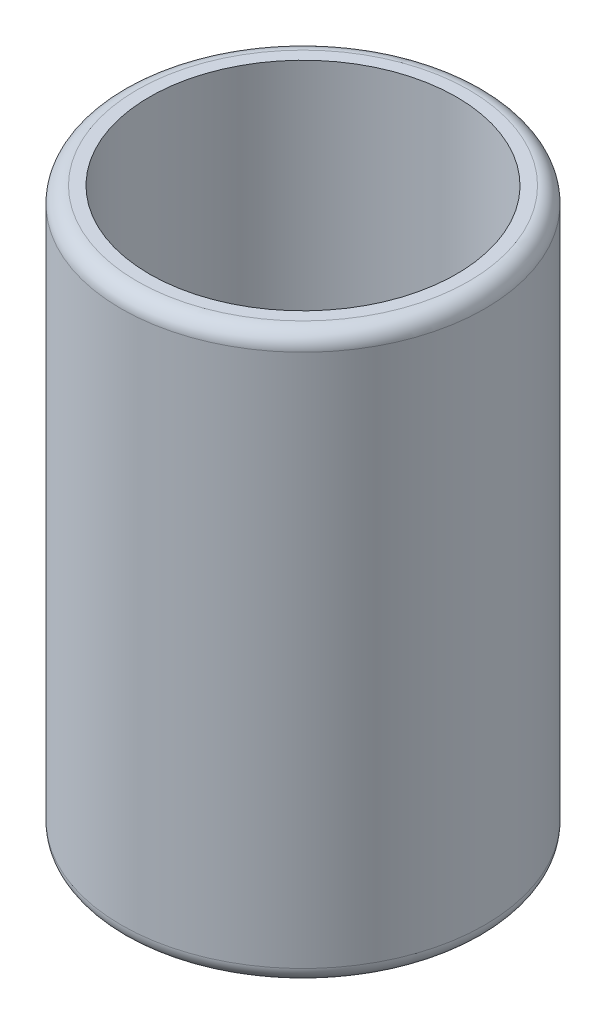
ISO-10303-21;
HEADER;
FILE_DESCRIPTION(('STEP AP214'),'2;1');
FILE_NAME('part.step','',(''),(''),'','','');
FILE_SCHEMA(('AUTOMOTIVE_DESIGN { 1 0 10303 214 1 1 1 1 }'));
ENDSEC;
DATA;
#1=APPLICATION_CONTEXT('core data for automotive mechanical design processes');
#2=APPLICATION_PROTOCOL_DEFINITION('international standard','automotive_design',2000,#1);
#3=PRODUCT_CONTEXT('',#1,'mechanical');
#4=PRODUCT('Part','Part','',(#3));
#5=PRODUCT_RELATED_PRODUCT_CATEGORY('part','',(#4));
#6=PRODUCT_DEFINITION_FORMATION('','',#4);
#7=PRODUCT_DEFINITION_CONTEXT('part definition',#1,'design');
#8=PRODUCT_DEFINITION('design','',#6,#7);
#9=PRODUCT_DEFINITION_SHAPE('','',#8);
#10=(LENGTH_UNIT() NAMED_UNIT(*) SI_UNIT(.MILLI.,.METRE.));
#11=(NAMED_UNIT(*) PLANE_ANGLE_UNIT() SI_UNIT($,.RADIAN.));
#12=(NAMED_UNIT(*) SI_UNIT($,.STERADIAN.) SOLID_ANGLE_UNIT());
#13=UNCERTAINTY_MEASURE_WITH_UNIT(LENGTH_MEASURE(1.E-05),#10,'distance_accuracy_value','');
#14=(GEOMETRIC_REPRESENTATION_CONTEXT(3) GLOBAL_UNCERTAINTY_ASSIGNED_CONTEXT((#13)) GLOBAL_UNIT_ASSIGNED_CONTEXT((#10,
#11,#12)) REPRESENTATION_CONTEXT('',''));
#15=CARTESIAN_POINT('',(0.,0.,0.));
#16=DIRECTION('',(0.,0.,1.));
#17=DIRECTION('',(1.,0.,0.));
#18=AXIS2_PLACEMENT_3D('',#15,#16,#17);
#19=CARTESIAN_POINT('',(0.,8.89,0.));
#20=DIRECTION('',(0.,-1.,0.));
#21=DIRECTION('',(0.,0.,-1.));
#22=AXIS2_PLACEMENT_3D('',#19,#20,#21);
#23=CYLINDRICAL_SURFACE('',#22,57.15);
#24=CARTESIAN_POINT('',(0.,5.,0.));
#25=DIRECTION('',(0.,1.,0.));
#26=DIRECTION('',(0.,0.,1.));
#27=AXIS2_PLACEMENT_3D('',#24,#25,#26);
#28=CIRCLE('',#27,57.15);
#29=CARTESIAN_POINT('',(0.,5.,-57.15));
#30=VERTEX_POINT('',#29);
#31=EDGE_CURVE('E56',#30,#30,#28,.T.);
#32=CARTESIAN_POINT('',(0.,172.8,0.));
#33=DIRECTION('',(0.,1.,0.));
#34=DIRECTION('',(0.,0.,1.));
#35=AXIS2_PLACEMENT_3D('',#32,#33,#34);
#36=CIRCLE('',#35,57.15);
#37=CARTESIAN_POINT('',(0.,172.8,-57.15));
#38=VERTEX_POINT('',#37);
#39=EDGE_CURVE('E61',#38,#38,#36,.F.);
#40=CARTESIAN_POINT('',(0.,5.,-57.15));
#41=CARTESIAN_POINT('',(0.,6.74791666666666,-57.15));
#42=CARTESIAN_POINT('',(0.,8.49583333333333,-57.15));
#43=CARTESIAN_POINT('',(0.,11.9916666666667,-57.15));
#44=CARTESIAN_POINT('',(0.,13.7395833333333,-57.15));
#45=CARTESIAN_POINT('',(0.,17.2354166666667,-57.15));
#46=CARTESIAN_POINT('',(0.,18.9833333333333,-57.15));
#47=CARTESIAN_POINT('',(0.,22.4791666666667,-57.15));
#48=CARTESIAN_POINT('',(0.,24.2270833333333,-57.15));
#49=CARTESIAN_POINT('',(0.,27.7229166666667,-57.15));
#50=CARTESIAN_POINT('',(0.,29.4708333333333,-57.15));
#51=CARTESIAN_POINT('',(0.,32.9666666666667,-57.15));
#52=CARTESIAN_POINT('',(0.,34.7145833333333,-57.15));
#53=CARTESIAN_POINT('',(0.,38.2104166666667,-57.15));
#54=CARTESIAN_POINT('',(0.,39.9583333333333,-57.15));
#55=CARTESIAN_POINT('',(0.,43.4541666666667,-57.15));
#56=CARTESIAN_POINT('',(0.,45.2020833333333,-57.15));
#57=CARTESIAN_POINT('',(0.,48.6979166666667,-57.15));
#58=CARTESIAN_POINT('',(0.,50.4458333333333,-57.15));
#59=CARTESIAN_POINT('',(0.,53.9416666666667,-57.15));
#60=CARTESIAN_POINT('',(0.,55.6895833333333,-57.15));
#61=CARTESIAN_POINT('',(0.,59.1854166666667,-57.15));
#62=CARTESIAN_POINT('',(0.,60.9333333333333,-57.15));
#63=CARTESIAN_POINT('',(0.,64.4291666666667,-57.15));
#64=CARTESIAN_POINT('',(0.,66.1770833333333,-57.15));
#65=CARTESIAN_POINT('',(0.,69.6729166666667,-57.15));
#66=CARTESIAN_POINT('',(0.,71.4208333333333,-57.15));
#67=CARTESIAN_POINT('',(0.,74.9166666666666,-57.15));
#68=CARTESIAN_POINT('',(0.,76.6645833333333,-57.15));
#69=CARTESIAN_POINT('',(0.,80.1604166666666,-57.15));
#70=CARTESIAN_POINT('',(0.,81.9083333333333,-57.15));
#71=CARTESIAN_POINT('',(0.,85.4041666666666,-57.15));
#72=CARTESIAN_POINT('',(0.,87.1520833333333,-57.15));
#73=CARTESIAN_POINT('',(0.,90.6479166666666,-57.15));
#74=CARTESIAN_POINT('',(0.,92.3958333333333,-57.15));
#75=CARTESIAN_POINT('',(0.,95.8916666666667,-57.15));
#76=CARTESIAN_POINT('',(0.,97.6395833333333,-57.15));
#77=CARTESIAN_POINT('',(0.,101.135416666667,-57.15));
#78=CARTESIAN_POINT('',(0.,102.883333333333,-57.15));
#79=CARTESIAN_POINT('',(0.,106.379166666667,-57.15));
#80=CARTESIAN_POINT('',(0.,108.127083333333,-57.15));
#81=CARTESIAN_POINT('',(0.,111.622916666667,-57.15));
#82=CARTESIAN_POINT('',(0.,113.370833333333,-57.15));
#83=CARTESIAN_POINT('',(0.,116.866666666667,-57.15));
#84=CARTESIAN_POINT('',(0.,118.614583333333,-57.15));
#85=CARTESIAN_POINT('',(0.,122.110416666667,-57.15));
#86=CARTESIAN_POINT('',(0.,123.858333333333,-57.15));
#87=CARTESIAN_POINT('',(0.,127.354166666667,-57.15));
#88=CARTESIAN_POINT('',(0.,129.102083333333,-57.15));
#89=CARTESIAN_POINT('',(0.,132.597916666667,-57.15));
#90=CARTESIAN_POINT('',(0.,134.345833333333,-57.15));
#91=CARTESIAN_POINT('',(0.,137.841666666667,-57.15));
#92=CARTESIAN_POINT('',(0.,139.589583333333,-57.15));
#93=CARTESIAN_POINT('',(0.,143.085416666667,-57.15));
#94=CARTESIAN_POINT('',(0.,144.833333333333,-57.15));
#95=CARTESIAN_POINT('',(0.,148.329166666667,-57.15));
#96=CARTESIAN_POINT('',(0.,150.077083333333,-57.15));
#97=CARTESIAN_POINT('',(0.,153.572916666667,-57.15));
#98=CARTESIAN_POINT('',(0.,155.320833333333,-57.15));
#99=CARTESIAN_POINT('',(0.,158.816666666667,-57.15));
#100=CARTESIAN_POINT('',(0.,160.564583333333,-57.15));
#101=CARTESIAN_POINT('',(0.,164.060416666667,-57.15));
#102=CARTESIAN_POINT('',(0.,165.808333333333,-57.15));
#103=CARTESIAN_POINT('',(0.,169.304166666667,-57.15));
#104=CARTESIAN_POINT('',(0.,171.052083333333,-57.15));
#105=CARTESIAN_POINT('',(0.,172.8,-57.15));
#106=B_SPLINE_CURVE_WITH_KNOTS('',3,(#40,#41,#42,#43,#44,#45,#46,#47,#48,#49,#50,#51,#52,#53,
#54,#55,#56,#57,#58,#59,#60,#61,#62,#63,#64,#65,#66,#67,#68,#69,#70,#71,#72,#73,#74,#75,#76,#77,
#78,#79,#80,#81,#82,#83,#84,#85,#86,#87,#88,#89,#90,#91,#92,#93,#94,#95,#96,#97,#98,#99,#100,
#101,#102,#103,#104,#105),.UNSPECIFIED.,.F.,.F.,(4,2,2,2,2,2,2,2,2,2,2,2,2,2,2,2,2,2,2,2,2,2,2,
2,2,2,2,2,2,2,2,2,4),(0.,5.24375,10.4875,15.73125,20.975,26.21875,31.4625,36.70625,41.95,
47.19375,52.4375,57.68125,62.925,68.16875,73.4125,78.65625,83.9,89.14375,94.3875,99.63125,
104.875,110.11875,115.3625,120.60625,125.85,131.09375,136.3375,141.58125,146.825,152.06875,
157.3125,162.55625,167.8),.UNSPECIFIED.);
#107=EDGE_CURVE('BSEAM43',#30,#38,#106,.T.);
#108=ORIENTED_EDGE('',*,*,#31,.T.);
#109=ORIENTED_EDGE('',*,*,#39,.T.);
#110=ORIENTED_EDGE('',*,*,#107,.T.);
#111=ORIENTED_EDGE('',*,*,#107,.F.);
#112=EDGE_LOOP('',(#108,#110,#109,#111));
#113=FACE_BOUND('',#112,.T.);
#114=ADVANCED_FACE('F43',(#113),#23,.T.);
#115=CARTESIAN_POINT('',(0.,0.,0.));
#116=DIRECTION('',(0.,1.,0.));
#117=DIRECTION('',(0.,0.,1.));
#118=AXIS2_PLACEMENT_3D('',#115,#116,#117);
#119=PLANE('',#118);
#120=CARTESIAN_POINT('',(0.,0.,0.));
#121=DIRECTION('',(0.,1.,0.));
#122=DIRECTION('',(0.,0.,1.));
#123=AXIS2_PLACEMENT_3D('',#120,#121,#122);
#124=CIRCLE('',#123,52.15);
#125=CARTESIAN_POINT('',(0.,0.,52.15));
#126=VERTEX_POINT('',#125);
#127=EDGE_CURVE('E51',#126,#126,#124,.F.);
#128=ORIENTED_EDGE('',*,*,#127,.T.);
#129=EDGE_LOOP('',(#128));
#130=FACE_BOUND('',#129,.T.);
#131=ADVANCED_FACE('F80',(#130),#119,.F.);
#132=CARTESIAN_POINT('',(0.,177.8,0.));
#133=DIRECTION('',(0.,1.,0.));
#134=DIRECTION('',(0.,0.,1.));
#135=AXIS2_PLACEMENT_3D('',#132,#133,#134);
#136=PLANE('',#135);
#137=CARTESIAN_POINT('',(0.,177.8,0.));
#138=DIRECTION('',(0.,1.,0.));
#139=DIRECTION('',(0.,0.,1.));
#140=AXIS2_PLACEMENT_3D('',#137,#138,#139);
#141=CIRCLE('',#140,52.15);
#142=CARTESIAN_POINT('',(0.,177.8,52.15));
#143=VERTEX_POINT('',#142);
#144=EDGE_CURVE('E10',#143,#143,#141,.T.);
#145=ORIENTED_EDGE('',*,*,#144,.T.);
#146=EDGE_LOOP('',(#145));
#147=FACE_BOUND('',#146,.T.);
#148=CARTESIAN_POINT('',(0.,177.8,0.));
#149=DIRECTION('',(0.,1.,0.));
#150=DIRECTION('',(0.,0.,1.));
#151=AXIS2_PLACEMENT_3D('',#148,#149,#150);
#152=CIRCLE('',#151,48.26);
#153=CARTESIAN_POINT('',(0.,177.8,48.26));
#154=VERTEX_POINT('',#153);
#155=EDGE_CURVE('E71',#154,#154,#152,.T.);
#156=ORIENTED_EDGE('',*,*,#155,.F.);
#157=EDGE_LOOP('',(#156));
#158=FACE_BOUND('',#157,.T.);
#159=ADVANCED_FACE('F78',(#147,#158),#136,.T.);
#160=CARTESIAN_POINT('',(0.,177.8,0.));
#161=DIRECTION('',(0.,-1.,0.));
#162=DIRECTION('',(0.,0.,-1.));
#163=AXIS2_PLACEMENT_3D('',#160,#161,#162);
#164=CYLINDRICAL_SURFACE('',#163,48.26);
#165=CARTESIAN_POINT('',(0.,8.89000000000001,0.));
#166=DIRECTION('',(0.,1.,0.));
#167=DIRECTION('',(0.,0.,1.));
#168=AXIS2_PLACEMENT_3D('',#165,#166,#167);
#169=CIRCLE('',#168,48.26);
#170=CARTESIAN_POINT('',(0.,8.89000000000001,48.26));
#171=VERTEX_POINT('',#170);
#172=EDGE_CURVE('E67',#171,#171,#169,.F.);
#173=ORIENTED_EDGE('',*,*,#172,.T.);
#174=EDGE_LOOP('',(#173));
#175=FACE_BOUND('',#174,.T.);
#176=ORIENTED_EDGE('',*,*,#155,.T.);
#177=EDGE_LOOP('',(#176));
#178=FACE_BOUND('',#177,.T.);
#179=ADVANCED_FACE('F76',(#175,#178),#164,.F.);
#180=CARTESIAN_POINT('',(0.,8.89,0.));
#181=DIRECTION('',(0.,1.,0.));
#182=DIRECTION('',(0.,0.,1.));
#183=AXIS2_PLACEMENT_3D('',#180,#181,#182);
#184=PLANE('',#183);
#185=ORIENTED_EDGE('',*,*,#172,.F.);
#186=EDGE_LOOP('',(#185));
#187=FACE_BOUND('',#186,.T.);
#188=ADVANCED_FACE('F87',(#187),#184,.T.);
#189=CARTESIAN_POINT('',(0.,5.,0.));
#190=DIRECTION('',(0.,1.,0.));
#191=DIRECTION('',(0.,0.,1.));
#192=AXIS2_PLACEMENT_3D('',#189,#190,#191);
#193=TOROIDAL_SURFACE('',#192,52.15,5.);
#194=ORIENTED_EDGE('',*,*,#127,.F.);
#195=EDGE_LOOP('',(#194));
#196=FACE_BOUND('',#195,.T.);
#197=ORIENTED_EDGE('',*,*,#31,.F.);
#198=EDGE_LOOP('',(#197));
#199=FACE_BOUND('',#198,.T.);
#200=ADVANCED_FACE('F99',(#196,#199),#193,.T.);
#201=CARTESIAN_POINT('',(0.,172.8,0.));
#202=DIRECTION('',(0.,1.,0.));
#203=DIRECTION('',(0.,0.,1.));
#204=AXIS2_PLACEMENT_3D('',#201,#202,#203);
#205=TOROIDAL_SURFACE('',#204,52.15,5.);
#206=ORIENTED_EDGE('',*,*,#39,.F.);
#207=EDGE_LOOP('',(#206));
#208=FACE_BOUND('',#207,.T.);
#209=ORIENTED_EDGE('',*,*,#144,.F.);
#210=EDGE_LOOP('',(#209));
#211=FACE_BOUND('',#210,.T.);
#212=ADVANCED_FACE('F45',(#208,#211),#205,.T.);
#213=CLOSED_SHELL('',(#114,#131,#159,#179,#188,#200,#212));
#214=MANIFOLD_SOLID_BREP('B2',#213);
#215=ADVANCED_BREP_SHAPE_REPRESENTATION('',(#18,#214),#14);
#216=SHAPE_DEFINITION_REPRESENTATION(#9,#215);
ENDSEC;
END-ISO-10303-21;
